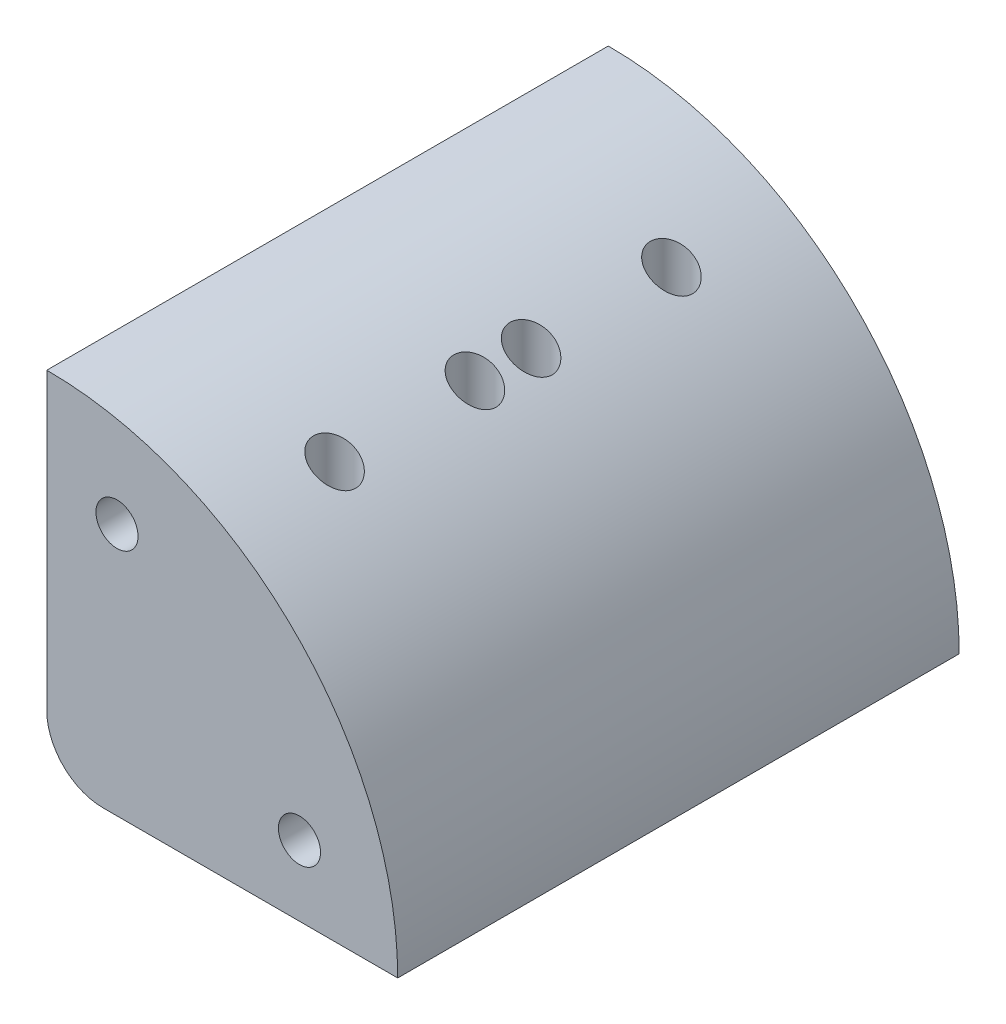
ISO-10303-21;
HEADER;
FILE_DESCRIPTION(('STEP AP214'),'2;1');
FILE_NAME('part.step','',(''),(''),'','','');
FILE_SCHEMA(('AUTOMOTIVE_DESIGN { 1 0 10303 214 1 1 1 1 }'));
ENDSEC;
DATA;
#1=APPLICATION_CONTEXT('core data for automotive mechanical design processes');
#2=APPLICATION_PROTOCOL_DEFINITION('international standard','automotive_design',2000,#1);
#3=PRODUCT_CONTEXT('',#1,'mechanical');
#4=PRODUCT('Part','Part','',(#3));
#5=PRODUCT_RELATED_PRODUCT_CATEGORY('part','',(#4));
#6=PRODUCT_DEFINITION_FORMATION('','',#4);
#7=PRODUCT_DEFINITION_CONTEXT('part definition',#1,'design');
#8=PRODUCT_DEFINITION('design','',#6,#7);
#9=PRODUCT_DEFINITION_SHAPE('','',#8);
#10=(LENGTH_UNIT() NAMED_UNIT(*) SI_UNIT(.MILLI.,.METRE.));
#11=(NAMED_UNIT(*) PLANE_ANGLE_UNIT() SI_UNIT($,.RADIAN.));
#12=(NAMED_UNIT(*) SI_UNIT($,.STERADIAN.) SOLID_ANGLE_UNIT());
#13=UNCERTAINTY_MEASURE_WITH_UNIT(LENGTH_MEASURE(1.E-05),#10,'distance_accuracy_value','');
#14=(GEOMETRIC_REPRESENTATION_CONTEXT(3) GLOBAL_UNCERTAINTY_ASSIGNED_CONTEXT((#13)) GLOBAL_UNIT_ASSIGNED_CONTEXT((#10,
#11,#12)) REPRESENTATION_CONTEXT('',''));
#15=CARTESIAN_POINT('',(0.,0.,0.));
#16=DIRECTION('',(0.,0.,1.));
#17=DIRECTION('',(1.,0.,0.));
#18=AXIS2_PLACEMENT_3D('',#15,#16,#17);
#19=CARTESIAN_POINT('',(83.3572761595632,-256.335501283086,40.));
#20=DIRECTION('',(0.,0.,-1.));
#21=DIRECTION('',(-1.,0.,0.));
#22=AXIS2_PLACEMENT_3D('',#19,#20,#21);
#23=CYLINDRICAL_SURFACE('',#22,25.);
#24=CARTESIAN_POINT('',(97.3572761595636,-235.623186105878,18.));
#25=CARTESIAN_POINT('',(97.3572722443463,-235.62318311714,18.0741618707151));
#26=CARTESIAN_POINT('',(97.3517421093072,-235.619442179836,18.1483665107502));
#27=CARTESIAN_POINT('',(97.3299453511948,-235.604734790577,18.2944755345032));
#28=CARTESIAN_POINT('',(97.3136677632032,-235.593760959397,18.3663774903099));
#29=CARTESIAN_POINT('',(97.2713825766795,-235.565371736274,18.5055406196379));
#30=CARTESIAN_POINT('',(97.2454160371594,-235.547983530107,18.5728199775593));
#31=CARTESIAN_POINT('',(97.184974637095,-235.507729727074,18.7016297195657));
#32=CARTESIAN_POINT('',(97.150498562506,-235.484863348658,18.7631592816063));
#33=CARTESIAN_POINT('',(97.0717043575153,-235.432945717864,18.8835682672932));
#34=CARTESIAN_POINT('',(97.0268708084883,-235.403576303526,18.9419708858227));
#35=CARTESIAN_POINT('',(96.9304606791928,-235.340931260367,19.050500345267));
#36=CARTESIAN_POINT('',(96.8788811705755,-235.307653935809,19.1006235706789));
#37=CARTESIAN_POINT('',(96.7613805856153,-235.2325252477,19.1997629774404));
#38=CARTESIAN_POINT('',(96.6944948578168,-235.190162844244,19.2472489230539));
#39=CARTESIAN_POINT('',(96.55516466747,-235.102919933727,19.3302393651625));
#40=CARTESIAN_POINT('',(96.4827166913821,-235.058037839931,19.3657362107217));
#41=CARTESIAN_POINT('',(96.3230027162347,-234.960284215581,19.4288099783496));
#42=CARTESIAN_POINT('',(96.2351129411254,-234.907199175687,19.4544874411856));
#43=CARTESIAN_POINT('',(96.0562829592045,-234.800737014389,19.4895321729823));
#44=CARTESIAN_POINT('',(95.965341304319,-234.747359764681,19.4988915844619));
#45=CARTESIAN_POINT('',(95.7764251568435,-234.638095553873,19.5009912340662));
#46=CARTESIAN_POINT('',(95.6783908331867,-234.582282863965,19.4925652212536));
#47=CARTESIAN_POINT('',(95.4843144252237,-234.473495091328,19.4562421346291));
#48=CARTESIAN_POINT('',(95.3882723426502,-234.420520011066,19.4283450438844));
#49=CARTESIAN_POINT('',(95.2050335972136,-234.320935096041,19.3542472950652));
#50=CARTESIAN_POINT('',(95.1176420097799,-234.274163480236,19.3087520918501));
#51=CARTESIAN_POINT('',(94.9515419679378,-234.186419724611,19.199785939684));
#52=CARTESIAN_POINT('',(94.8728266826535,-234.145443015147,19.1363292743362));
#53=CARTESIAN_POINT('',(94.7361758487343,-234.075090213982,19.0006749258077));
#54=CARTESIAN_POINT('',(94.6769029666808,-234.044930846985,18.9302337447601));
#55=CARTESIAN_POINT('',(94.5713889292099,-233.991661442981,18.7778527785594));
#56=CARTESIAN_POINT('',(94.5251349966656,-233.968544492518,18.6959243864189));
#57=CARTESIAN_POINT('',(94.4530790934611,-233.932720642334,18.5339478208217));
#58=CARTESIAN_POINT('',(94.4254595328656,-233.919082119016,18.4549114554284));
#59=CARTESIAN_POINT('',(94.3836953092104,-233.898508766572,18.2925278504814));
#60=CARTESIAN_POINT('',(94.3695425813986,-233.891569925236,18.2091832225478));
#61=CARTESIAN_POINT('',(94.356040547789,-233.884950530955,18.0479346761697));
#62=CARTESIAN_POINT('',(94.3555733443848,-233.88472185722,17.9701444886813));
#63=CARTESIAN_POINT('',(94.3666367507961,-233.890145026267,17.8156406281116));
#64=CARTESIAN_POINT('',(94.378165074825,-233.895795748712,17.738926752758));
#65=CARTESIAN_POINT('',(94.4123393938607,-233.912612854191,17.5902928254893));
#66=CARTESIAN_POINT('',(94.4347599302368,-233.92366741058,17.518307808398));
#67=CARTESIAN_POINT('',(94.4896666027048,-233.950890124577,17.3793319520323));
#68=CARTESIAN_POINT('',(94.5221538255213,-233.967058834275,17.3123416529197));
#69=CARTESIAN_POINT('',(94.5973947084897,-234.00476983971,17.1823465326034));
#70=CARTESIAN_POINT('',(94.6404998795712,-234.026497396139,17.1195996726124));
#71=CARTESIAN_POINT('',(94.734656463611,-234.074369145257,17.0023091498398));
#72=CARTESIAN_POINT('',(94.7857102794886,-234.100514673729,16.9477679775192));
#73=CARTESIAN_POINT('',(94.8987703662967,-234.158975668745,16.8434205227076));
#74=CARTESIAN_POINT('',(94.9613391253842,-234.191626977433,16.7944132002417));
#75=CARTESIAN_POINT('',(95.0919520754644,-234.26056434945,16.707545266218));
#76=CARTESIAN_POINT('',(95.15999856351,-234.296851939208,16.6696893622717));
#77=CARTESIAN_POINT('',(95.307609570482,-234.376509604835,16.6017205186929));
#78=CARTESIAN_POINT('',(95.3876101861912,-234.420217629875,16.5729511670514));
#79=CARTESIAN_POINT('',(95.5499709824266,-234.510130238748,16.5294091316108));
#80=CARTESIAN_POINT('',(95.6323321983267,-234.556335926194,16.5146426894383));
#81=CARTESIAN_POINT('',(95.8065733881841,-234.655416067921,16.4980339160792));
#82=CARTESIAN_POINT('',(95.8985071235393,-234.708466324734,16.4977857441745));
#83=CARTESIAN_POINT('',(96.0806391074617,-234.815111121372,16.5139053574315));
#84=CARTESIAN_POINT('',(96.1708361305702,-234.868706007494,16.5302844667198));
#85=CARTESIAN_POINT('',(96.3528955538376,-234.978397831544,16.580898671492));
#86=CARTESIAN_POINT('',(96.4444981751878,-235.034436735193,16.6162045261222));
#87=CARTESIAN_POINT('',(96.6204325210846,-235.143536291978,16.7049005047504));
#88=CARTESIAN_POINT('',(96.7047698401068,-235.196599225501,16.7582765552132));
#89=CARTESIAN_POINT('',(96.8482039257307,-235.287919353606,16.8709512146321));
#90=CARTESIAN_POINT('',(96.9090687197961,-235.327087455732,16.9272644995139));
#91=CARTESIAN_POINT('',(97.0219747683794,-235.400350544618,17.0510612184516));
#92=CARTESIAN_POINT('',(97.0740169582899,-235.434446069139,17.1185434668475));
#93=CARTESIAN_POINT('',(97.1673644449293,-235.496004500003,17.2643185099897));
#94=CARTESIAN_POINT('',(97.2085695757956,-235.523405374134,17.3427025729378));
#95=CARTESIAN_POINT('',(97.276990475175,-235.569103599696,17.5077251670135));
#96=CARTESIAN_POINT('',(97.3042417956987,-235.587424082611,17.5943420471716));
#97=CARTESIAN_POINT('',(97.3346381753728,-235.607898418709,17.7350268909108));
#98=CARTESIAN_POINT('',(97.343100582474,-235.613610427926,17.7874910936505));
#99=CARTESIAN_POINT('',(97.354420604699,-235.62125509158,17.8932962292725));
#100=CARTESIAN_POINT('',(97.3572789767468,-235.623188256416,17.9466370427714));
#101=CARTESIAN_POINT('',(97.3572761595636,-235.623186105878,18.));
#102=B_SPLINE_CURVE_WITH_KNOTS('',3,(#24,#25,#26,#27,#28,#29,#30,#31,#32,#33,#34,#35,#36,#37,
#38,#39,#40,#41,#42,#43,#44,#45,#46,#47,#48,#49,#50,#51,#52,#53,#54,#55,#56,#57,#58,#59,#60,#61,
#62,#63,#64,#65,#66,#67,#68,#69,#70,#71,#72,#73,#74,#75,#76,#77,#78,#79,#80,#81,#82,#83,#84,#85,
#86,#87,#88,#89,#90,#91,#92,#93,#94,#95,#96,#97,#98,#99,#100,#101),.UNSPECIFIED.,.T.,.F.,(4,2,2,
2,2,2,2,2,2,2,2,2,2,2,2,2,2,2,2,2,2,2,2,2,2,2,2,2,2,2,2,2,2,2,2,2,2,2,4),(0.,0.222269354945683,
0.444765827801711,0.666329939030888,0.887925678822406,1.12483147055866,1.36184044401797,
1.63772653646541,1.91378835654242,2.22995108477449,2.54626600993416,2.88396425831366,
3.22166280036827,3.5470318798408,3.87214293753513,4.16110404465313,4.44978056123505,
4.70289335769684,4.95585447937138,5.18808940666478,5.42028008893954,5.64785716379451,
5.87545881474128,6.11195262152039,6.34851806100402,6.60523265050471,6.8620554581955,
7.14766634429555,7.43340447821788,7.75046481315508,8.06774122922815,8.40522401185502,
8.74244455653805,9.01645779956667,9.2904419728932,9.56687600240712,9.84260217452366,
10.0025570451926,10.1624903096427),.UNSPECIFIED.);
#103=CARTESIAN_POINT('',(97.3572761595636,-235.623186105878,18.));
#104=VERTEX_POINT('',#103);
#105=EDGE_CURVE('E168',#104,#104,#102,.T.);
#106=ORIENTED_EDGE('',*,*,#105,.T.);
#107=EDGE_LOOP('',(#106));
#108=FACE_BOUND('',#107,.T.);
#109=CARTESIAN_POINT('',(97.3572761595636,-235.623186105878,22.));
#110=CARTESIAN_POINT('',(97.3572722443463,-235.62318311714,22.0741618707151));
#111=CARTESIAN_POINT('',(97.3517421093072,-235.619442179836,22.1483665107502));
#112=CARTESIAN_POINT('',(97.3299453511948,-235.604734790577,22.2944755345032));
#113=CARTESIAN_POINT('',(97.3136677632032,-235.593760959397,22.3663774903099));
#114=CARTESIAN_POINT('',(97.2713825766795,-235.565371736274,22.5055406196379));
#115=CARTESIAN_POINT('',(97.2454160371594,-235.547983530107,22.5728199775593));
#116=CARTESIAN_POINT('',(97.184974637095,-235.507729727074,22.7016297195657));
#117=CARTESIAN_POINT('',(97.150498562506,-235.484863348658,22.7631592816062));
#118=CARTESIAN_POINT('',(97.0717043575153,-235.432945717864,22.8835682672932));
#119=CARTESIAN_POINT('',(97.0268708084883,-235.403576303526,22.9419708858227));
#120=CARTESIAN_POINT('',(96.9304606791928,-235.340931260367,23.050500345267));
#121=CARTESIAN_POINT('',(96.8788811705755,-235.307653935809,23.1006235706789));
#122=CARTESIAN_POINT('',(96.7613805856153,-235.2325252477,23.1997629774404));
#123=CARTESIAN_POINT('',(96.6944948578168,-235.190162844244,23.2472489230539));
#124=CARTESIAN_POINT('',(96.55516466747,-235.102919933727,23.3302393651625));
#125=CARTESIAN_POINT('',(96.4827166913821,-235.058037839931,23.3657362107217));
#126=CARTESIAN_POINT('',(96.3230027162347,-234.960284215581,23.4288099783496));
#127=CARTESIAN_POINT('',(96.2351129411254,-234.907199175687,23.4544874411856));
#128=CARTESIAN_POINT('',(96.0562829592045,-234.800737014389,23.4895321729823));
#129=CARTESIAN_POINT('',(95.965341304319,-234.747359764681,23.4988915844619));
#130=CARTESIAN_POINT('',(95.7764251568435,-234.638095553873,23.5009912340662));
#131=CARTESIAN_POINT('',(95.6783908331867,-234.582282863965,23.4925652212536));
#132=CARTESIAN_POINT('',(95.4843144252237,-234.473495091328,23.4562421346291));
#133=CARTESIAN_POINT('',(95.3882723426502,-234.420520011066,23.4283450438844));
#134=CARTESIAN_POINT('',(95.2050335972136,-234.320935096041,23.3542472950652));
#135=CARTESIAN_POINT('',(95.1176420097799,-234.274163480236,23.3087520918501));
#136=CARTESIAN_POINT('',(94.9515419679378,-234.186419724611,23.199785939684));
#137=CARTESIAN_POINT('',(94.8728266826535,-234.145443015147,23.1363292743362));
#138=CARTESIAN_POINT('',(94.7361758487343,-234.075090213982,23.0006749258077));
#139=CARTESIAN_POINT('',(94.6769029666808,-234.044930846985,22.9302337447601));
#140=CARTESIAN_POINT('',(94.5713889292099,-233.991661442981,22.7778527785594));
#141=CARTESIAN_POINT('',(94.5251349966656,-233.968544492518,22.6959243864189));
#142=CARTESIAN_POINT('',(94.4530790934611,-233.932720642334,22.5339478208217));
#143=CARTESIAN_POINT('',(94.4254595328656,-233.919082119016,22.4549114554284));
#144=CARTESIAN_POINT('',(94.3836953092104,-233.898508766572,22.2925278504814));
#145=CARTESIAN_POINT('',(94.3695425813986,-233.891569925236,22.2091832225478));
#146=CARTESIAN_POINT('',(94.356040547789,-233.884950530955,22.0479346761697));
#147=CARTESIAN_POINT('',(94.3555733443848,-233.88472185722,21.9701444886813));
#148=CARTESIAN_POINT('',(94.3666367507961,-233.890145026267,21.8156406281116));
#149=CARTESIAN_POINT('',(94.378165074825,-233.895795748712,21.738926752758));
#150=CARTESIAN_POINT('',(94.4123393938607,-233.912612854191,21.5902928254893));
#151=CARTESIAN_POINT('',(94.4347599302368,-233.92366741058,21.518307808398));
#152=CARTESIAN_POINT('',(94.4896666027048,-233.950890124577,21.3793319520323));
#153=CARTESIAN_POINT('',(94.5221538255213,-233.967058834275,21.3123416529197));
#154=CARTESIAN_POINT('',(94.5973947084897,-234.00476983971,21.1823465326034));
#155=CARTESIAN_POINT('',(94.6404998795712,-234.026497396139,21.1195996726124));
#156=CARTESIAN_POINT('',(94.734656463611,-234.074369145257,21.0023091498397));
#157=CARTESIAN_POINT('',(94.7857102794886,-234.100514673729,20.9477679775192));
#158=CARTESIAN_POINT('',(94.8987703662967,-234.158975668745,20.8434205227076));
#159=CARTESIAN_POINT('',(94.9613391253842,-234.191626977433,20.7944132002417));
#160=CARTESIAN_POINT('',(95.0919520754644,-234.26056434945,20.707545266218));
#161=CARTESIAN_POINT('',(95.15999856351,-234.296851939208,20.6696893622717));
#162=CARTESIAN_POINT('',(95.307609570482,-234.376509604835,20.6017205186929));
#163=CARTESIAN_POINT('',(95.3876101861912,-234.420217629875,20.5729511670514));
#164=CARTESIAN_POINT('',(95.5499709824266,-234.510130238748,20.5294091316108));
#165=CARTESIAN_POINT('',(95.6323321983267,-234.556335926194,20.5146426894383));
#166=CARTESIAN_POINT('',(95.8065733881841,-234.655416067921,20.4980339160792));
#167=CARTESIAN_POINT('',(95.8985071235393,-234.708466324734,20.4977857441745));
#168=CARTESIAN_POINT('',(96.0806391074617,-234.815111121372,20.5139053574315));
#169=CARTESIAN_POINT('',(96.1708361305702,-234.868706007494,20.5302844667198));
#170=CARTESIAN_POINT('',(96.3528955538376,-234.978397831544,20.580898671492));
#171=CARTESIAN_POINT('',(96.4444981751878,-235.034436735193,20.6162045261222));
#172=CARTESIAN_POINT('',(96.6204325210846,-235.143536291978,20.7049005047504));
#173=CARTESIAN_POINT('',(96.7047698401068,-235.196599225501,20.7582765552132));
#174=CARTESIAN_POINT('',(96.8482039257307,-235.287919353606,20.8709512146321));
#175=CARTESIAN_POINT('',(96.9090687197961,-235.327087455732,20.9272644995139));
#176=CARTESIAN_POINT('',(97.0219747683794,-235.400350544618,21.0510612184516));
#177=CARTESIAN_POINT('',(97.0740169582899,-235.434446069139,21.1185434668475));
#178=CARTESIAN_POINT('',(97.1673644449293,-235.496004500003,21.2643185099897));
#179=CARTESIAN_POINT('',(97.2085695757956,-235.523405374134,21.3427025729378));
#180=CARTESIAN_POINT('',(97.276990475175,-235.569103599696,21.5077251670135));
#181=CARTESIAN_POINT('',(97.3042417956987,-235.587424082611,21.5943420471716));
#182=CARTESIAN_POINT('',(97.3346381753728,-235.607898418709,21.7350268909108));
#183=CARTESIAN_POINT('',(97.343100582474,-235.613610427926,21.7874910936505));
#184=CARTESIAN_POINT('',(97.354420604699,-235.62125509158,21.8932962292725));
#185=CARTESIAN_POINT('',(97.3572789767468,-235.623188256416,21.9466370427714));
#186=CARTESIAN_POINT('',(97.3572761595636,-235.623186105878,22.));
#187=B_SPLINE_CURVE_WITH_KNOTS('',3,(#109,#110,#111,#112,#113,#114,#115,#116,#117,#118,#119,
#120,#121,#122,#123,#124,#125,#126,#127,#128,#129,#130,#131,#132,#133,#134,#135,#136,#137,#138,
#139,#140,#141,#142,#143,#144,#145,#146,#147,#148,#149,#150,#151,#152,#153,#154,#155,#156,#157,
#158,#159,#160,#161,#162,#163,#164,#165,#166,#167,#168,#169,#170,#171,#172,#173,#174,#175,#176,
#177,#178,#179,#180,#181,#182,#183,#184,#185,#186),.UNSPECIFIED.,.T.,.F.,(4,2,2,2,2,2,2,2,2,2,2,
2,2,2,2,2,2,2,2,2,2,2,2,2,2,2,2,2,2,2,2,2,2,2,2,2,2,2,4),(0.,0.222269354945683,
0.444765827801711,0.666329939030888,0.887925678822406,1.12483147055866,1.36184044401797,
1.63772653646541,1.91378835654242,2.22995108477449,2.54626600993416,2.88396425831366,
3.22166280036827,3.5470318798408,3.87214293753513,4.16110404465313,4.44978056123505,
4.70289335769684,4.95585447937138,5.18808940666478,5.42028008893954,5.64785716379451,
5.87545881474128,6.11195262152039,6.34851806100402,6.60523265050471,6.8620554581955,
7.14766634429555,7.43340447821788,7.75046481315508,8.06774122922815,8.40522401185502,
8.74244455653805,9.01645779956667,9.2904419728932,9.56687600240712,9.84260217452366,
10.0025570451926,10.1624903096427),.UNSPECIFIED.);
#188=CARTESIAN_POINT('',(97.3572761595636,-235.623186105878,22.));
#189=VERTEX_POINT('',#188);
#190=EDGE_CURVE('E172',#189,#189,#187,.T.);
#191=ORIENTED_EDGE('',*,*,#190,.T.);
#192=EDGE_LOOP('',(#191));
#193=FACE_BOUND('',#192,.T.);
#194=CARTESIAN_POINT('',(97.3572761595636,-235.623186105878,32.));
#195=CARTESIAN_POINT('',(97.3572722443463,-235.62318311714,32.0741618707151));
#196=CARTESIAN_POINT('',(97.3517421093072,-235.619442179836,32.1483665107502));
#197=CARTESIAN_POINT('',(97.3299453511948,-235.604734790577,32.2944755345032));
#198=CARTESIAN_POINT('',(97.3136677632032,-235.593760959397,32.3663774903099));
#199=CARTESIAN_POINT('',(97.2713825766795,-235.565371736274,32.5055406196379));
#200=CARTESIAN_POINT('',(97.2454160371594,-235.547983530107,32.5728199775593));
#201=CARTESIAN_POINT('',(97.184974637095,-235.507729727074,32.7016297195657));
#202=CARTESIAN_POINT('',(97.150498562506,-235.484863348658,32.7631592816062));
#203=CARTESIAN_POINT('',(97.0717043575153,-235.432945717864,32.8835682672932));
#204=CARTESIAN_POINT('',(97.0268708084883,-235.403576303526,32.9419708858227));
#205=CARTESIAN_POINT('',(96.9304606791928,-235.340931260367,33.050500345267));
#206=CARTESIAN_POINT('',(96.8788811705755,-235.307653935809,33.1006235706789));
#207=CARTESIAN_POINT('',(96.7613805856153,-235.2325252477,33.1997629774404));
#208=CARTESIAN_POINT('',(96.6944948578168,-235.190162844244,33.2472489230539));
#209=CARTESIAN_POINT('',(96.55516466747,-235.102919933727,33.3302393651625));
#210=CARTESIAN_POINT('',(96.4827166913821,-235.058037839931,33.3657362107217));
#211=CARTESIAN_POINT('',(96.3230027162347,-234.960284215581,33.4288099783496));
#212=CARTESIAN_POINT('',(96.2351129411254,-234.907199175687,33.4544874411856));
#213=CARTESIAN_POINT('',(96.0562829592045,-234.800737014389,33.4895321729823));
#214=CARTESIAN_POINT('',(95.965341304319,-234.747359764681,33.4988915844619));
#215=CARTESIAN_POINT('',(95.7764251568435,-234.638095553873,33.5009912340662));
#216=CARTESIAN_POINT('',(95.6783908331867,-234.582282863965,33.4925652212536));
#217=CARTESIAN_POINT('',(95.4843144252237,-234.473495091328,33.4562421346291));
#218=CARTESIAN_POINT('',(95.3882723426502,-234.420520011066,33.4283450438844));
#219=CARTESIAN_POINT('',(95.2050335972136,-234.320935096041,33.3542472950652));
#220=CARTESIAN_POINT('',(95.1176420097799,-234.274163480236,33.3087520918501));
#221=CARTESIAN_POINT('',(94.9515419679378,-234.186419724611,33.199785939684));
#222=CARTESIAN_POINT('',(94.8728266826535,-234.145443015147,33.1363292743362));
#223=CARTESIAN_POINT('',(94.7361758487343,-234.075090213982,33.0006749258077));
#224=CARTESIAN_POINT('',(94.6769029666808,-234.044930846985,32.9302337447601));
#225=CARTESIAN_POINT('',(94.5713889292099,-233.991661442981,32.7778527785594));
#226=CARTESIAN_POINT('',(94.5251349966656,-233.968544492518,32.6959243864189));
#227=CARTESIAN_POINT('',(94.4530790934611,-233.932720642334,32.5339478208217));
#228=CARTESIAN_POINT('',(94.4254595328656,-233.919082119016,32.4549114554284));
#229=CARTESIAN_POINT('',(94.3836953092104,-233.898508766572,32.2925278504814));
#230=CARTESIAN_POINT('',(94.3695425813986,-233.891569925236,32.2091832225478));
#231=CARTESIAN_POINT('',(94.356040547789,-233.884950530955,32.0479346761697));
#232=CARTESIAN_POINT('',(94.3555733443848,-233.88472185722,31.9701444886813));
#233=CARTESIAN_POINT('',(94.3666367507961,-233.890145026267,31.8156406281116));
#234=CARTESIAN_POINT('',(94.378165074825,-233.895795748712,31.7389267527581));
#235=CARTESIAN_POINT('',(94.4123393938607,-233.912612854191,31.5902928254893));
#236=CARTESIAN_POINT('',(94.4347599302368,-233.92366741058,31.518307808398));
#237=CARTESIAN_POINT('',(94.4896666027048,-233.950890124577,31.3793319520323));
#238=CARTESIAN_POINT('',(94.5221538255213,-233.967058834275,31.3123416529197));
#239=CARTESIAN_POINT('',(94.5973947084897,-234.00476983971,31.1823465326034));
#240=CARTESIAN_POINT('',(94.6404998795712,-234.026497396139,31.1195996726124));
#241=CARTESIAN_POINT('',(94.734656463611,-234.074369145257,31.0023091498398));
#242=CARTESIAN_POINT('',(94.7857102794886,-234.100514673729,30.9477679775192));
#243=CARTESIAN_POINT('',(94.8987703662967,-234.158975668745,30.8434205227076));
#244=CARTESIAN_POINT('',(94.9613391253842,-234.191626977433,30.7944132002417));
#245=CARTESIAN_POINT('',(95.0919520754644,-234.26056434945,30.707545266218));
#246=CARTESIAN_POINT('',(95.1599985635099,-234.296851939208,30.6696893622717));
#247=CARTESIAN_POINT('',(95.307609570482,-234.376509604835,30.6017205186929));
#248=CARTESIAN_POINT('',(95.3876101861912,-234.420217629875,30.5729511670514));
#249=CARTESIAN_POINT('',(95.5499709824266,-234.510130238748,30.5294091316108));
#250=CARTESIAN_POINT('',(95.6323321983267,-234.556335926194,30.5146426894383));
#251=CARTESIAN_POINT('',(95.8065733881841,-234.655416067921,30.4980339160792));
#252=CARTESIAN_POINT('',(95.8985071235393,-234.708466324734,30.4977857441745));
#253=CARTESIAN_POINT('',(96.0806391074617,-234.815111121372,30.5139053574315));
#254=CARTESIAN_POINT('',(96.1708361305702,-234.868706007494,30.5302844667198));
#255=CARTESIAN_POINT('',(96.3528955538376,-234.978397831544,30.580898671492));
#256=CARTESIAN_POINT('',(96.4444981751878,-235.034436735193,30.6162045261222));
#257=CARTESIAN_POINT('',(96.6204325210846,-235.143536291978,30.7049005047504));
#258=CARTESIAN_POINT('',(96.7047698401068,-235.196599225501,30.7582765552132));
#259=CARTESIAN_POINT('',(96.8482039257307,-235.287919353606,30.8709512146321));
#260=CARTESIAN_POINT('',(96.9090687197961,-235.327087455732,30.9272644995139));
#261=CARTESIAN_POINT('',(97.0219747683794,-235.400350544618,31.0510612184516));
#262=CARTESIAN_POINT('',(97.0740169582899,-235.434446069139,31.1185434668475));
#263=CARTESIAN_POINT('',(97.1673644449292,-235.496004500003,31.2643185099896));
#264=CARTESIAN_POINT('',(97.2085695757956,-235.523405374134,31.3427025729378));
#265=CARTESIAN_POINT('',(97.276990475175,-235.569103599696,31.5077251670134));
#266=CARTESIAN_POINT('',(97.3042417956987,-235.587424082611,31.5943420471716));
#267=CARTESIAN_POINT('',(97.3346381753728,-235.607898418709,31.7350268909107));
#268=CARTESIAN_POINT('',(97.343100582474,-235.613610427926,31.7874910936505));
#269=CARTESIAN_POINT('',(97.354420604699,-235.62125509158,31.8932962292725));
#270=CARTESIAN_POINT('',(97.3572789767468,-235.623188256416,31.9466370427714));
#271=CARTESIAN_POINT('',(97.3572761595636,-235.623186105878,32.));
#272=B_SPLINE_CURVE_WITH_KNOTS('',3,(#194,#195,#196,#197,#198,#199,#200,#201,#202,#203,#204,
#205,#206,#207,#208,#209,#210,#211,#212,#213,#214,#215,#216,#217,#218,#219,#220,#221,#222,#223,
#224,#225,#226,#227,#228,#229,#230,#231,#232,#233,#234,#235,#236,#237,#238,#239,#240,#241,#242,
#243,#244,#245,#246,#247,#248,#249,#250,#251,#252,#253,#254,#255,#256,#257,#258,#259,#260,#261,
#262,#263,#264,#265,#266,#267,#268,#269,#270,#271),.UNSPECIFIED.,.T.,.F.,(4,2,2,2,2,2,2,2,2,2,2,
2,2,2,2,2,2,2,2,2,2,2,2,2,2,2,2,2,2,2,2,2,2,2,2,2,2,2,4),(0.,0.222269354945683,
0.444765827801711,0.666329939030888,0.887925678822401,1.12483147055866,1.36184044401797,
1.63772653646541,1.91378835654241,2.22995108477448,2.54626600993415,2.88396425831366,
3.22166280036826,3.54703187984079,3.87214293753513,4.16110404465315,4.44978056123505,
4.70289335769684,4.95585447937138,5.18808940666478,5.42028008893953,5.64785716379451,
5.87545881474128,6.11195262152038,6.34851806100402,6.60523265050467,6.8620554581955,
7.14766634429556,7.43340447821788,7.75046481315508,8.06774122922815,8.40522401185502,
8.74244455653805,9.01645779956666,9.29044197289318,9.5668760024071,9.84260217452361,
10.0025570451926,10.1624903096427),.UNSPECIFIED.);
#273=CARTESIAN_POINT('',(97.3572761595636,-235.623186105878,32.));
#274=VERTEX_POINT('',#273);
#275=EDGE_CURVE('E176',#274,#274,#272,.T.);
#276=ORIENTED_EDGE('',*,*,#275,.T.);
#277=EDGE_LOOP('',(#276));
#278=FACE_BOUND('',#277,.T.);
#279=CARTESIAN_POINT('',(97.3572761595638,-235.623186105878,8.));
#280=CARTESIAN_POINT('',(97.3572722443465,-235.62318311714,8.07416187071509));
#281=CARTESIAN_POINT('',(97.3517421093073,-235.619442179836,8.14836651075017));
#282=CARTESIAN_POINT('',(97.329945351195,-235.604734790578,8.29447553450316));
#283=CARTESIAN_POINT('',(97.3136677632033,-235.593760959397,8.36637749030994));
#284=CARTESIAN_POINT('',(97.2713825766797,-235.565371736274,8.50554061963786));
#285=CARTESIAN_POINT('',(97.2454160371595,-235.547983530107,8.57281997755931));
#286=CARTESIAN_POINT('',(97.1849746370951,-235.507729727074,8.70162971956572));
#287=CARTESIAN_POINT('',(97.1504985625062,-235.484863348658,8.76315928160626));
#288=CARTESIAN_POINT('',(97.0717043575155,-235.432945717864,8.88356826729323));
#289=CARTESIAN_POINT('',(97.0268708084885,-235.403576303526,8.94197088582272));
#290=CARTESIAN_POINT('',(96.9304606791929,-235.340931260367,9.05050034526701));
#291=CARTESIAN_POINT('',(96.8788811705756,-235.307653935809,9.10062357067886));
#292=CARTESIAN_POINT('',(96.7613805856155,-235.2325252477,9.19976297744038));
#293=CARTESIAN_POINT('',(96.694494857817,-235.190162844244,9.2472489230539));
#294=CARTESIAN_POINT('',(96.5551646674702,-235.102919933728,9.33023936516251));
#295=CARTESIAN_POINT('',(96.4827166913822,-235.058037839931,9.36573621072173));
#296=CARTESIAN_POINT('',(96.3230027162348,-234.960284215581,9.42880997834963));
#297=CARTESIAN_POINT('',(96.2351129411255,-234.907199175687,9.45448744118563));
#298=CARTESIAN_POINT('',(96.0562829592047,-234.800737014389,9.48953217298232));
#299=CARTESIAN_POINT('',(95.9653413043192,-234.747359764681,9.49889158446187));
#300=CARTESIAN_POINT('',(95.7764251568436,-234.638095553873,9.50099123406619));
#301=CARTESIAN_POINT('',(95.6783908331868,-234.582282863965,9.49256522125365));
#302=CARTESIAN_POINT('',(95.4843144252239,-234.473495091328,9.45624213462912));
#303=CARTESIAN_POINT('',(95.3882723426504,-234.420520011066,9.42834504388438));
#304=CARTESIAN_POINT('',(95.2050335972138,-234.320935096041,9.35424729506514));
#305=CARTESIAN_POINT('',(95.1176420097801,-234.274163480236,9.30875209185007));
#306=CARTESIAN_POINT('',(94.951541967938,-234.186419724611,9.19978593968394));
#307=CARTESIAN_POINT('',(94.8728266826536,-234.145443015147,9.1363292743362));
#308=CARTESIAN_POINT('',(94.7361758487344,-234.075090213982,9.00067492580765));
#309=CARTESIAN_POINT('',(94.676902966681,-234.044930846986,8.93023374476011));
#310=CARTESIAN_POINT('',(94.57138892921,-233.991661442981,8.77785277855934));
#311=CARTESIAN_POINT('',(94.5251349966657,-233.968544492518,8.6959243864189));
#312=CARTESIAN_POINT('',(94.4530790934612,-233.932720642334,8.53394782082167));
#313=CARTESIAN_POINT('',(94.4254595328658,-233.919082119016,8.45491145542843));
#314=CARTESIAN_POINT('',(94.3836953092105,-233.898508766573,8.29252785048141));
#315=CARTESIAN_POINT('',(94.3695425813988,-233.891569925236,8.20918322254778));
#316=CARTESIAN_POINT('',(94.3560405477892,-233.884950530956,8.04793467616968));
#317=CARTESIAN_POINT('',(94.3555733443849,-233.88472185722,7.97014448868133));
#318=CARTESIAN_POINT('',(94.3666367507963,-233.890145026267,7.8156406281116));
#319=CARTESIAN_POINT('',(94.3781650748252,-233.895795748712,7.73892675275804));
#320=CARTESIAN_POINT('',(94.4123393938609,-233.912612854191,7.59029282548931));
#321=CARTESIAN_POINT('',(94.4347599302369,-233.92366741058,7.51830780839799));
#322=CARTESIAN_POINT('',(94.4896666027049,-233.950890124577,7.37933195203234));
#323=CARTESIAN_POINT('',(94.5221538255214,-233.967058834275,7.31234165291972));
#324=CARTESIAN_POINT('',(94.5973947084898,-234.00476983971,7.1823465326034));
#325=CARTESIAN_POINT('',(94.6404998795714,-234.026497396139,7.11959967261243));
#326=CARTESIAN_POINT('',(94.7346564636112,-234.074369145257,7.00230914983975));
#327=CARTESIAN_POINT('',(94.7857102794887,-234.100514673729,6.94776797751916));
#328=CARTESIAN_POINT('',(94.8987703662968,-234.158975668745,6.84342052270758));
#329=CARTESIAN_POINT('',(94.9613391253843,-234.191626977433,6.79441320024169));
#330=CARTESIAN_POINT('',(95.0919520754645,-234.26056434945,6.70754526621798));
#331=CARTESIAN_POINT('',(95.1599985635101,-234.296851939208,6.66968936227173));
#332=CARTESIAN_POINT('',(95.3076095704821,-234.376509604836,6.60172051869293));
#333=CARTESIAN_POINT('',(95.3876101861913,-234.420217629875,6.57295116705145));
#334=CARTESIAN_POINT('',(95.5499709824268,-234.510130238748,6.52940913161085));
#335=CARTESIAN_POINT('',(95.6323321983269,-234.556335926194,6.51464268943834));
#336=CARTESIAN_POINT('',(95.8065733881843,-234.655416067921,6.49803391607917));
#337=CARTESIAN_POINT('',(95.8985071235395,-234.708466324734,6.49778574417453));
#338=CARTESIAN_POINT('',(96.0806391074619,-234.815111121372,6.51390535743145));
#339=CARTESIAN_POINT('',(96.1708361305703,-234.868706007494,6.53028446671978));
#340=CARTESIAN_POINT('',(96.3528955538377,-234.978397831544,6.580898671492));
#341=CARTESIAN_POINT('',(96.4444981751879,-235.034436735193,6.61620452612215));
#342=CARTESIAN_POINT('',(96.6204325210847,-235.143536291978,6.70490050475042));
#343=CARTESIAN_POINT('',(96.7047698401069,-235.196599225501,6.75827655521319));
#344=CARTESIAN_POINT('',(96.8482039257309,-235.287919353606,6.87095121463212));
#345=CARTESIAN_POINT('',(96.9090687197963,-235.327087455732,6.92726449951386));
#346=CARTESIAN_POINT('',(97.0219747683796,-235.400350544618,7.05106121845161));
#347=CARTESIAN_POINT('',(97.07401695829,-235.434446069139,7.11854346684749));
#348=CARTESIAN_POINT('',(97.1673644449294,-235.496004500004,7.26431850998966));
#349=CARTESIAN_POINT('',(97.2085695757957,-235.523405374134,7.34270257293783));
#350=CARTESIAN_POINT('',(97.2769904751752,-235.569103599696,7.50772516701345));
#351=CARTESIAN_POINT('',(97.3042417956988,-235.587424082611,7.59434204717161));
#352=CARTESIAN_POINT('',(97.334638175373,-235.607898418709,7.73502689091076));
#353=CARTESIAN_POINT('',(97.3431005824741,-235.613610427926,7.7874910936505));
#354=CARTESIAN_POINT('',(97.3544206046991,-235.62125509158,7.89329622927248));
#355=CARTESIAN_POINT('',(97.3572789767469,-235.623188256416,7.94663704277141));
#356=CARTESIAN_POINT('',(97.3572761595638,-235.623186105878,8.));
#357=B_SPLINE_CURVE_WITH_KNOTS('',3,(#279,#280,#281,#282,#283,#284,#285,#286,#287,#288,#289,
#290,#291,#292,#293,#294,#295,#296,#297,#298,#299,#300,#301,#302,#303,#304,#305,#306,#307,#308,
#309,#310,#311,#312,#313,#314,#315,#316,#317,#318,#319,#320,#321,#322,#323,#324,#325,#326,#327,
#328,#329,#330,#331,#332,#333,#334,#335,#336,#337,#338,#339,#340,#341,#342,#343,#344,#345,#346,
#347,#348,#349,#350,#351,#352,#353,#354,#355,#356),.UNSPECIFIED.,.T.,.F.,(4,2,2,2,2,2,2,2,2,2,2,
2,2,2,2,2,2,2,2,2,2,2,2,2,2,2,2,2,2,2,2,2,2,2,2,2,2,2,4),(0.,0.222269354945685,
0.444765827801714,0.666329939030891,0.887925678822406,1.12483147055866,1.36184044401796,
1.6377265364654,1.91378835654243,2.2299510847745,2.54626600993415,2.88396425831369,
3.2216628003683,3.54703187984083,3.87214293753518,4.16110404465319,4.44978056123509,
4.70289335769687,4.9558544793714,5.18808940666479,5.42028008893955,5.64785716379452,
5.8754588147413,6.1119526215204,6.34851806100404,6.6052326505047,6.86205545819552,
7.14766634429555,7.4334044782179,7.7504648131551,8.06774122922819,8.40522401185502,
8.74244455653807,9.01645779956669,9.29044197289321,9.56687600240714,9.84260217452366,
10.0025570451927,10.1624903096428),.UNSPECIFIED.);
#358=CARTESIAN_POINT('',(97.3572761595638,-235.623186105878,8.));
#359=VERTEX_POINT('',#358);
#360=EDGE_CURVE('E122',#359,#359,#357,.T.);
#361=ORIENTED_EDGE('',*,*,#360,.T.);
#362=EDGE_LOOP('',(#361));
#363=FACE_BOUND('',#362,.T.);
#364=CARTESIAN_POINT('',(83.3572761595632,-256.335501283086,0.));
#365=DIRECTION('',(0.,0.,1.));
#366=DIRECTION('',(1.,0.,0.));
#367=AXIS2_PLACEMENT_3D('',#364,#365,#366);
#368=CIRCLE('',#367,25.);
#369=CARTESIAN_POINT('',(108.357276159563,-256.335501283086,0.));
#370=VERTEX_POINT('',#369);
#371=CARTESIAN_POINT('',(83.357276159563,-231.335501283086,0.));
#372=VERTEX_POINT('',#371);
#373=EDGE_CURVE('E99',#370,#372,#368,.T.);
#374=ORIENTED_EDGE('',*,*,#373,.T.);
#375=DIRECTION('',(0.,0.,-1.));
#376=VECTOR('',#375,1.);
#377=CARTESIAN_POINT('',(83.357276159563,-231.335501283086,40.));
#378=LINE('',#377,#376);
#379=CARTESIAN_POINT('',(83.357276159563,-231.335501283086,40.));
#380=VERTEX_POINT('',#379);
#381=EDGE_CURVE('E11',#380,#372,#378,.T.);
#382=ORIENTED_EDGE('',*,*,#381,.F.);
#383=CARTESIAN_POINT('',(83.3572761595632,-256.335501283086,40.));
#384=DIRECTION('',(0.,0.,1.));
#385=DIRECTION('',(1.,0.,0.));
#386=AXIS2_PLACEMENT_3D('',#383,#384,#385);
#387=CIRCLE('',#386,25.);
#388=CARTESIAN_POINT('',(108.357276159563,-256.335501283086,40.));
#389=VERTEX_POINT('',#388);
#390=EDGE_CURVE('E85',#389,#380,#387,.T.);
#391=ORIENTED_EDGE('',*,*,#390,.F.);
#392=DIRECTION('',(0.,0.,-1.));
#393=VECTOR('',#392,1.);
#394=CARTESIAN_POINT('',(108.357276159563,-256.335501283086,40.));
#395=LINE('',#394,#393);
#396=EDGE_CURVE('E95',#389,#370,#395,.T.);
#397=ORIENTED_EDGE('',*,*,#396,.T.);
#398=EDGE_LOOP('',(#374,#382,#391,#397));
#399=FACE_BOUND('',#398,.T.);
#400=ADVANCED_FACE('F34',(#108,#193,#278,#363,#399),#23,.T.);
#401=CARTESIAN_POINT('',(83.3572761595632,-252.335501283086,40.));
#402=DIRECTION('',(1.,0.,0.));
#403=DIRECTION('',(0.,0.,-1.));
#404=AXIS2_PLACEMENT_3D('',#401,#402,#403);
#405=PLANE('',#404);
#406=DIRECTION('',(0.,-1.,0.));
#407=VECTOR('',#406,1.);
#408=CARTESIAN_POINT('',(83.3572761595632,-252.335501283086,0.));
#409=LINE('',#408,#407);
#410=CARTESIAN_POINT('',(83.3572761595632,-252.335501283086,0.));
#411=VERTEX_POINT('',#410);
#412=EDGE_CURVE('E90',#372,#411,#409,.T.);
#413=ORIENTED_EDGE('',*,*,#412,.T.);
#414=DIRECTION('',(0.,0.,-1.));
#415=VECTOR('',#414,1.);
#416=CARTESIAN_POINT('',(83.3572761595632,-252.335501283086,40.));
#417=LINE('',#416,#415);
#418=CARTESIAN_POINT('',(83.3572761595632,-252.335501283086,40.));
#419=VERTEX_POINT('',#418);
#420=EDGE_CURVE('E43',#419,#411,#417,.T.);
#421=ORIENTED_EDGE('',*,*,#420,.F.);
#422=DIRECTION('',(0.,-1.,0.));
#423=VECTOR('',#422,1.);
#424=CARTESIAN_POINT('',(83.357276159563,-231.335501283086,40.));
#425=LINE('',#424,#423);
#426=EDGE_CURVE('E79',#380,#419,#425,.T.);
#427=ORIENTED_EDGE('',*,*,#426,.F.);
#428=ORIENTED_EDGE('',*,*,#381,.T.);
#429=EDGE_LOOP('',(#413,#421,#427,#428));
#430=FACE_BOUND('',#429,.T.);
#431=ADVANCED_FACE('F89',(#430),#405,.F.);
#432=CARTESIAN_POINT('',(87.3572761595632,-252.335501283086,40.));
#433=DIRECTION('',(0.,0.,-1.));
#434=DIRECTION('',(-1.,0.,0.));
#435=AXIS2_PLACEMENT_3D('',#432,#433,#434);
#436=CYLINDRICAL_SURFACE('',#435,4.);
#437=CARTESIAN_POINT('',(87.3572761595632,-252.335501283086,0.));
#438=DIRECTION('',(0.,0.,1.));
#439=DIRECTION('',(-1.,0.,0.));
#440=AXIS2_PLACEMENT_3D('',#437,#438,#439);
#441=CIRCLE('',#440,4.);
#442=CARTESIAN_POINT('',(87.3572761595632,-256.335501283086,0.));
#443=VERTEX_POINT('',#442);
#444=EDGE_CURVE('E104',#411,#443,#441,.T.);
#445=ORIENTED_EDGE('',*,*,#444,.T.);
#446=DIRECTION('',(0.,0.,-1.));
#447=VECTOR('',#446,1.);
#448=CARTESIAN_POINT('',(87.3572761595632,-256.335501283086,40.));
#449=LINE('',#448,#447);
#450=CARTESIAN_POINT('',(87.3572761595632,-256.335501283086,40.));
#451=VERTEX_POINT('',#450);
#452=EDGE_CURVE('E92',#451,#443,#449,.T.);
#453=ORIENTED_EDGE('',*,*,#452,.F.);
#454=CARTESIAN_POINT('',(87.3572761595632,-252.335501283086,40.));
#455=DIRECTION('',(0.,0.,1.));
#456=DIRECTION('',(-1.,0.,0.));
#457=AXIS2_PLACEMENT_3D('',#454,#455,#456);
#458=CIRCLE('',#457,4.);
#459=EDGE_CURVE('E82',#419,#451,#458,.T.);
#460=ORIENTED_EDGE('',*,*,#459,.F.);
#461=ORIENTED_EDGE('',*,*,#420,.T.);
#462=EDGE_LOOP('',(#445,#453,#460,#461));
#463=FACE_BOUND('',#462,.T.);
#464=ADVANCED_FACE('F93',(#463),#436,.T.);
#465=CARTESIAN_POINT('',(108.357276159563,-256.335501283086,40.));
#466=DIRECTION('',(0.,1.,0.));
#467=DIRECTION('',(-1.,0.,0.));
#468=AXIS2_PLACEMENT_3D('',#465,#466,#467);
#469=PLANE('',#468);
#470=CARTESIAN_POINT('',(95.8572761595629,-256.335501283086,18.));
#471=DIRECTION('',(0.,-1.,0.));
#472=DIRECTION('',(1.,0.,0.));
#473=AXIS2_PLACEMENT_3D('',#470,#471,#472);
#474=CIRCLE('',#473,1.5);
#475=CARTESIAN_POINT('',(97.3572761595629,-256.335501283086,18.));
#476=VERTEX_POINT('',#475);
#477=EDGE_CURVE('E180',#476,#476,#474,.T.);
#478=ORIENTED_EDGE('',*,*,#477,.F.);
#479=EDGE_LOOP('',(#478));
#480=FACE_BOUND('',#479,.T.);
#481=CARTESIAN_POINT('',(95.8572761595629,-256.335501283086,22.));
#482=DIRECTION('',(0.,-1.,0.));
#483=DIRECTION('',(1.,0.,0.));
#484=AXIS2_PLACEMENT_3D('',#481,#482,#483);
#485=CIRCLE('',#484,1.5);
#486=CARTESIAN_POINT('',(97.3572761595629,-256.335501283086,22.));
#487=VERTEX_POINT('',#486);
#488=EDGE_CURVE('E184',#487,#487,#485,.T.);
#489=ORIENTED_EDGE('',*,*,#488,.F.);
#490=EDGE_LOOP('',(#489));
#491=FACE_BOUND('',#490,.T.);
#492=CARTESIAN_POINT('',(95.8572761595629,-256.335501283086,32.));
#493=DIRECTION('',(0.,-1.,0.));
#494=DIRECTION('',(1.,0.,0.));
#495=AXIS2_PLACEMENT_3D('',#492,#493,#494);
#496=CIRCLE('',#495,1.5);
#497=CARTESIAN_POINT('',(97.3572761595629,-256.335501283086,32.));
#498=VERTEX_POINT('',#497);
#499=EDGE_CURVE('E189',#498,#498,#496,.T.);
#500=ORIENTED_EDGE('',*,*,#499,.F.);
#501=EDGE_LOOP('',(#500));
#502=FACE_BOUND('',#501,.T.);
#503=CARTESIAN_POINT('',(95.8572761595631,-256.335501283086,8.));
#504=DIRECTION('',(0.,-1.,0.));
#505=DIRECTION('',(1.,0.,0.));
#506=AXIS2_PLACEMENT_3D('',#503,#504,#505);
#507=CIRCLE('',#506,1.5);
#508=CARTESIAN_POINT('',(97.3572761595631,-256.335501283086,8.));
#509=VERTEX_POINT('',#508);
#510=EDGE_CURVE('E128',#509,#509,#507,.T.);
#511=ORIENTED_EDGE('',*,*,#510,.F.);
#512=EDGE_LOOP('',(#511));
#513=FACE_BOUND('',#512,.T.);
#514=DIRECTION('',(1.,0.,0.));
#515=VECTOR('',#514,1.);
#516=CARTESIAN_POINT('',(108.357276159563,-256.335501283086,0.));
#517=LINE('',#516,#515);
#518=EDGE_CURVE('E68',#443,#370,#517,.T.);
#519=ORIENTED_EDGE('',*,*,#518,.T.);
#520=ORIENTED_EDGE('',*,*,#396,.F.);
#521=DIRECTION('',(1.,0.,0.));
#522=VECTOR('',#521,1.);
#523=CARTESIAN_POINT('',(103.357276159563,-256.335501283086,40.));
#524=LINE('',#523,#522);
#525=EDGE_CURVE('E51',#451,#389,#524,.T.);
#526=ORIENTED_EDGE('',*,*,#525,.F.);
#527=ORIENTED_EDGE('',*,*,#452,.T.);
#528=EDGE_LOOP('',(#519,#520,#526,#527));
#529=FACE_BOUND('',#528,.T.);
#530=ADVANCED_FACE('F108',(#480,#491,#502,#513,#529),#469,.F.);
#531=CARTESIAN_POINT('',(83.3572761595632,-256.335501283086,40.));
#532=DIRECTION('',(0.,0.,1.));
#533=DIRECTION('',(1.,0.,0.));
#534=AXIS2_PLACEMENT_3D('',#531,#532,#533);
#535=PLANE('',#534);
#536=CARTESIAN_POINT('',(101.357276159563,-251.335501283086,40.));
#537=DIRECTION('',(0.,0.,1.));
#538=DIRECTION('',(1.,0.,0.));
#539=AXIS2_PLACEMENT_3D('',#536,#537,#538);
#540=CIRCLE('',#539,1.5);
#541=CARTESIAN_POINT('',(102.857276159563,-251.335501283086,40.));
#542=VERTEX_POINT('',#541);
#543=EDGE_CURVE('E116',#542,#542,#540,.F.);
#544=ORIENTED_EDGE('',*,*,#543,.T.);
#545=EDGE_LOOP('',(#544));
#546=FACE_BOUND('',#545,.T.);
#547=CARTESIAN_POINT('',(88.357276159563,-238.335501283086,40.));
#548=DIRECTION('',(0.,0.,1.));
#549=DIRECTION('',(1.,0.,0.));
#550=AXIS2_PLACEMENT_3D('',#547,#548,#549);
#551=CIRCLE('',#550,1.5);
#552=CARTESIAN_POINT('',(89.857276159563,-238.335501283086,40.));
#553=VERTEX_POINT('',#552);
#554=EDGE_CURVE('E102',#553,#553,#551,.F.);
#555=ORIENTED_EDGE('',*,*,#554,.T.);
#556=EDGE_LOOP('',(#555));
#557=FACE_BOUND('',#556,.T.);
#558=ORIENTED_EDGE('',*,*,#390,.T.);
#559=ORIENTED_EDGE('',*,*,#426,.T.);
#560=ORIENTED_EDGE('',*,*,#459,.T.);
#561=ORIENTED_EDGE('',*,*,#525,.T.);
#562=EDGE_LOOP('',(#558,#559,#560,#561));
#563=FACE_BOUND('',#562,.T.);
#564=ADVANCED_FACE('F80',(#546,#557,#563),#535,.T.);
#565=CARTESIAN_POINT('',(83.3572761595632,-256.335501283086,0.));
#566=DIRECTION('',(0.,0.,1.));
#567=DIRECTION('',(1.,0.,0.));
#568=AXIS2_PLACEMENT_3D('',#565,#566,#567);
#569=PLANE('',#568);
#570=CARTESIAN_POINT('',(101.357276159563,-251.335501283086,0.));
#571=DIRECTION('',(0.,0.,-1.));
#572=DIRECTION('',(-1.,0.,0.));
#573=AXIS2_PLACEMENT_3D('',#570,#571,#572);
#574=CIRCLE('',#573,1.5);
#575=CARTESIAN_POINT('',(99.8572761595632,-251.335501283086,0.));
#576=VERTEX_POINT('',#575);
#577=EDGE_CURVE('E119',#576,#576,#574,.T.);
#578=ORIENTED_EDGE('',*,*,#577,.F.);
#579=EDGE_LOOP('',(#578));
#580=FACE_BOUND('',#579,.T.);
#581=CARTESIAN_POINT('',(88.357276159563,-238.335501283086,0.));
#582=DIRECTION('',(0.,0.,-1.));
#583=DIRECTION('',(-1.,0.,0.));
#584=AXIS2_PLACEMENT_3D('',#581,#582,#583);
#585=CIRCLE('',#584,1.5);
#586=CARTESIAN_POINT('',(86.857276159563,-238.335501283086,0.));
#587=VERTEX_POINT('',#586);
#588=EDGE_CURVE('E113',#587,#587,#585,.T.);
#589=ORIENTED_EDGE('',*,*,#588,.F.);
#590=EDGE_LOOP('',(#589));
#591=FACE_BOUND('',#590,.T.);
#592=ORIENTED_EDGE('',*,*,#373,.F.);
#593=ORIENTED_EDGE('',*,*,#518,.F.);
#594=ORIENTED_EDGE('',*,*,#444,.F.);
#595=ORIENTED_EDGE('',*,*,#412,.F.);
#596=EDGE_LOOP('',(#592,#593,#594,#595));
#597=FACE_BOUND('',#596,.T.);
#598=ADVANCED_FACE('F146',(#580,#591,#597),#569,.F.);
#599=CARTESIAN_POINT('',(88.357276159563,-238.335501283086,44.2426406871193));
#600=DIRECTION('',(0.,0.,-1.));
#601=DIRECTION('',(-1.,0.,0.));
#602=AXIS2_PLACEMENT_3D('',#599,#600,#601);
#603=CYLINDRICAL_SURFACE('',#602,1.5);
#604=ORIENTED_EDGE('',*,*,#588,.T.);
#605=EDGE_LOOP('',(#604));
#606=FACE_BOUND('',#605,.T.);
#607=ORIENTED_EDGE('',*,*,#554,.F.);
#608=EDGE_LOOP('',(#607));
#609=FACE_BOUND('',#608,.T.);
#610=ADVANCED_FACE('F142',(#606,#609),#603,.F.);
#611=CARTESIAN_POINT('',(101.357276159563,-251.335501283086,44.2426406871193));
#612=DIRECTION('',(0.,0.,-1.));
#613=DIRECTION('',(-1.,0.,0.));
#614=AXIS2_PLACEMENT_3D('',#611,#612,#613);
#615=CYLINDRICAL_SURFACE('',#614,1.5);
#616=ORIENTED_EDGE('',*,*,#577,.T.);
#617=EDGE_LOOP('',(#616));
#618=FACE_BOUND('',#617,.T.);
#619=ORIENTED_EDGE('',*,*,#543,.F.);
#620=EDGE_LOOP('',(#619));
#621=FACE_BOUND('',#620,.T.);
#622=ADVANCED_FACE('F136',(#618,#621),#615,.F.);
#623=CARTESIAN_POINT('',(95.8572761595639,-231.335501283085,8.));
#624=DIRECTION('',(0.,-1.,0.));
#625=DIRECTION('',(1.,0.,0.));
#626=AXIS2_PLACEMENT_3D('',#623,#624,#625);
#627=CYLINDRICAL_SURFACE('',#626,1.5);
#628=ORIENTED_EDGE('',*,*,#510,.T.);
#629=EDGE_LOOP('',(#628));
#630=FACE_BOUND('',#629,.T.);
#631=ORIENTED_EDGE('',*,*,#360,.F.);
#632=EDGE_LOOP('',(#631));
#633=FACE_BOUND('',#632,.T.);
#634=ADVANCED_FACE('F130',(#630,#633),#627,.F.);
#635=CARTESIAN_POINT('',(95.8572761595638,-231.335501283085,32.));
#636=DIRECTION('',(0.,-1.,0.));
#637=DIRECTION('',(1.,0.,0.));
#638=AXIS2_PLACEMENT_3D('',#635,#636,#637);
#639=CYLINDRICAL_SURFACE('',#638,1.5);
#640=ORIENTED_EDGE('',*,*,#499,.T.);
#641=EDGE_LOOP('',(#640));
#642=FACE_BOUND('',#641,.T.);
#643=ORIENTED_EDGE('',*,*,#275,.F.);
#644=EDGE_LOOP('',(#643));
#645=FACE_BOUND('',#644,.T.);
#646=ADVANCED_FACE('F135',(#642,#645),#639,.F.);
#647=CARTESIAN_POINT('',(95.8572761595638,-231.335501283085,22.));
#648=DIRECTION('',(0.,-1.,0.));
#649=DIRECTION('',(1.,0.,0.));
#650=AXIS2_PLACEMENT_3D('',#647,#648,#649);
#651=CYLINDRICAL_SURFACE('',#650,1.5);
#652=ORIENTED_EDGE('',*,*,#488,.T.);
#653=EDGE_LOOP('',(#652));
#654=FACE_BOUND('',#653,.T.);
#655=ORIENTED_EDGE('',*,*,#190,.F.);
#656=EDGE_LOOP('',(#655));
#657=FACE_BOUND('',#656,.T.);
#658=ADVANCED_FACE('F196',(#654,#657),#651,.F.);
#659=CARTESIAN_POINT('',(95.8572761595638,-231.335501283085,18.));
#660=DIRECTION('',(0.,-1.,0.));
#661=DIRECTION('',(1.,0.,0.));
#662=AXIS2_PLACEMENT_3D('',#659,#660,#661);
#663=CYLINDRICAL_SURFACE('',#662,1.5);
#664=ORIENTED_EDGE('',*,*,#477,.T.);
#665=EDGE_LOOP('',(#664));
#666=FACE_BOUND('',#665,.T.);
#667=ORIENTED_EDGE('',*,*,#105,.F.);
#668=EDGE_LOOP('',(#667));
#669=FACE_BOUND('',#668,.T.);
#670=ADVANCED_FACE('F199',(#666,#669),#663,.F.);
#671=CLOSED_SHELL('',(#400,#431,#464,#530,#564,#598,#610,#622,#634,#646,#658,#670));
#672=MANIFOLD_SOLID_BREP('B2',#671);
#673=ADVANCED_BREP_SHAPE_REPRESENTATION('',(#18,#672),#14);
#674=SHAPE_DEFINITION_REPRESENTATION(#9,#673);
ENDSEC;
END-ISO-10303-21;
